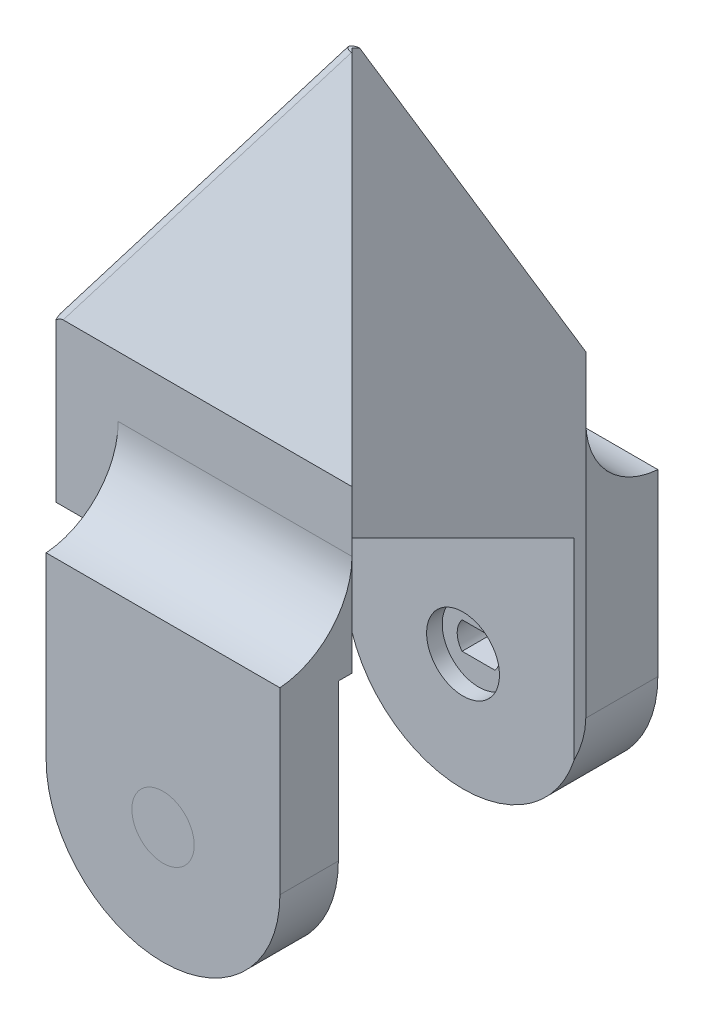
ISO-10303-21;
HEADER;
FILE_DESCRIPTION(('STEP AP214'),'2;1');
FILE_NAME('part.step','',(''),(''),'','','');
FILE_SCHEMA(('AUTOMOTIVE_DESIGN { 1 0 10303 214 1 1 1 1 }'));
ENDSEC;
DATA;
#1=APPLICATION_CONTEXT('core data for automotive mechanical design processes');
#2=APPLICATION_PROTOCOL_DEFINITION('international standard','automotive_design',2000,#1);
#3=PRODUCT_CONTEXT('',#1,'mechanical');
#4=PRODUCT('Part','Part','',(#3));
#5=PRODUCT_RELATED_PRODUCT_CATEGORY('part','',(#4));
#6=PRODUCT_DEFINITION_FORMATION('','',#4);
#7=PRODUCT_DEFINITION_CONTEXT('part definition',#1,'design');
#8=PRODUCT_DEFINITION('design','',#6,#7);
#9=PRODUCT_DEFINITION_SHAPE('','',#8);
#10=(LENGTH_UNIT() NAMED_UNIT(*) SI_UNIT(.MILLI.,.METRE.));
#11=(NAMED_UNIT(*) PLANE_ANGLE_UNIT() SI_UNIT($,.RADIAN.));
#12=(NAMED_UNIT(*) SI_UNIT($,.STERADIAN.) SOLID_ANGLE_UNIT());
#13=UNCERTAINTY_MEASURE_WITH_UNIT(LENGTH_MEASURE(1.E-05),#10,'distance_accuracy_value','');
#14=(GEOMETRIC_REPRESENTATION_CONTEXT(3) GLOBAL_UNCERTAINTY_ASSIGNED_CONTEXT((#13)) GLOBAL_UNIT_ASSIGNED_CONTEXT((#10,
#11,#12)) REPRESENTATION_CONTEXT('',''));
#15=CARTESIAN_POINT('',(0.,0.,0.));
#16=DIRECTION('',(0.,0.,1.));
#17=DIRECTION('',(1.,0.,0.));
#18=AXIS2_PLACEMENT_3D('',#15,#16,#17);
#19=CARTESIAN_POINT('',(1.4137996329211E-13,-20.0001000000003,-1.61370849898476));
#20=DIRECTION('',(0.,0.,1.));
#21=DIRECTION('',(1.,0.,0.));
#22=AXIS2_PLACEMENT_3D('',#19,#20,#21);
#23=CYLINDRICAL_SURFACE('',#22,4.);
#24=CARTESIAN_POINT('',(1.4137996329211E-13,-20.0001000000003,16.2));
#25=DIRECTION('',(0.,0.,1.));
#26=DIRECTION('',(1.,0.,0.));
#27=AXIS2_PLACEMENT_3D('',#24,#25,#26);
#28=CIRCLE('',#27,4.);
#29=CARTESIAN_POINT('',(4.00000000000014,-20.0001000000003,16.2));
#30=VERTEX_POINT('',#29);
#31=EDGE_CURVE('E12',#30,#30,#28,.F.);
#32=ORIENTED_EDGE('',*,*,#31,.F.);
#33=EDGE_LOOP('',(#32));
#34=FACE_BOUND('',#33,.T.);
#35=CARTESIAN_POINT('',(1.4137996329211E-13,-20.0001000000003,30.2));
#36=DIRECTION('',(0.,0.,1.));
#37=DIRECTION('',(1.,0.,0.));
#38=AXIS2_PLACEMENT_3D('',#35,#36,#37);
#39=CIRCLE('',#38,4.);
#40=CARTESIAN_POINT('',(4.00000000000014,-20.0001000000003,30.2));
#41=VERTEX_POINT('',#40);
#42=EDGE_CURVE('E58',#41,#41,#39,.T.);
#43=ORIENTED_EDGE('',*,*,#42,.F.);
#44=EDGE_LOOP('',(#43));
#45=FACE_BOUND('',#44,.T.);
#46=ADVANCED_FACE('F52',(#34,#45),#23,.T.);
#47=CARTESIAN_POINT('',(1.4137996329211E-13,-20.0001000000003,30.2));
#48=DIRECTION('',(0.,0.,1.));
#49=DIRECTION('',(1.,0.,0.));
#50=AXIS2_PLACEMENT_3D('',#47,#48,#49);
#51=PLANE('',#50);
#52=ORIENTED_EDGE('',*,*,#42,.T.);
#53=EDGE_LOOP('',(#52));
#54=FACE_BOUND('',#53,.T.);
#55=ADVANCED_FACE('F64',(#54),#51,.T.);
#56=CARTESIAN_POINT('',(23.0000000000001,-35.0001000000003,16.2));
#57=DIRECTION('',(0.,0.,1.));
#58=DIRECTION('',(1.,0.,0.));
#59=AXIS2_PLACEMENT_3D('',#56,#57,#58);
#60=PLANE('',#59);
#61=ORIENTED_EDGE('',*,*,#31,.T.);
#62=EDGE_LOOP('',(#61));
#63=FACE_BOUND('',#62,.T.);
#64=ADVANCED_FACE('F71',(#63),#60,.F.);
#65=CLOSED_SHELL('',(#46,#55,#64));
#66=MANIFOLD_SOLID_BREP('B2',#65);
#67=CARTESIAN_POINT('',(15.0000000000001,-0.000100000000315126,-18.3));
#68=DIRECTION('',(1.,0.,0.));
#69=DIRECTION('',(0.,1.,0.));
#70=AXIS2_PLACEMENT_3D('',#67,#68,#69);
#71=PLANE('',#70);
#72=DIRECTION('',(0.,1.,0.));
#73=VECTOR('',#72,1.);
#74=CARTESIAN_POINT('',(15.0000000000001,-35.0001000000003,20.95));
#75=LINE('',#74,#73);
#76=CARTESIAN_POINT('',(15.0000000000001,-9.99999997530754E-05,20.95));
#77=VERTEX_POINT('',#76);
#78=CARTESIAN_POINT('',(15.0000000000001,12.9717353375892,20.95));
#79=VERTEX_POINT('',#78);
#80=EDGE_CURVE('E285',#77,#79,#75,.T.);
#81=ORIENTED_EDGE('',*,*,#80,.T.);
#82=CARTESIAN_POINT('',(15.0000000000001,12.9717353375892,30.95));
#83=DIRECTION('',(1.,0.,0.));
#84=DIRECTION('',(0.,1.,0.));
#85=AXIS2_PLACEMENT_3D('',#82,#83,#84);
#86=CIRCLE('',#85,10.);
#87=CARTESIAN_POINT('',(15.0000000000001,2.99989999999968,30.2));
#88=VERTEX_POINT('',#87);
#89=EDGE_CURVE('E364',#79,#88,#86,.F.);
#90=ORIENTED_EDGE('',*,*,#89,.T.);
#91=DIRECTION('',(0.,1.,0.));
#92=VECTOR('',#91,1.);
#93=CARTESIAN_POINT('',(15.0000000000001,-0.000100000000315126,30.2));
#94=LINE('',#93,#92);
#95=CARTESIAN_POINT('',(15.0000000000001,-20.0001000000003,30.2));
#96=VERTEX_POINT('',#95);
#97=EDGE_CURVE('E344',#96,#88,#94,.T.);
#98=ORIENTED_EDGE('',*,*,#97,.F.);
#99=DIRECTION('',(0.,0.,1.));
#100=VECTOR('',#99,1.);
#101=CARTESIAN_POINT('',(15.0000000000001,-20.0001000000003,-18.3));
#102=LINE('',#101,#100);
#103=CARTESIAN_POINT('',(15.0000000000001,-20.0001000000003,22.7));
#104=VERTEX_POINT('',#103);
#105=EDGE_CURVE('E348',#104,#96,#102,.T.);
#106=ORIENTED_EDGE('',*,*,#105,.F.);
#107=DIRECTION('',(0.,-1.,0.));
#108=VECTOR('',#107,1.);
#109=CARTESIAN_POINT('',(15.0000000000001,-0.000100000000315126,22.7));
#110=LINE('',#109,#108);
#111=CARTESIAN_POINT('',(15.0000000000001,-9.99999997488304E-05,22.7));
#112=VERTEX_POINT('',#111);
#113=EDGE_CURVE('E336',#112,#104,#110,.T.);
#114=ORIENTED_EDGE('',*,*,#113,.F.);
#115=DIRECTION('',(0.,0.,-1.));
#116=VECTOR('',#115,1.);
#117=CARTESIAN_POINT('',(15.0000000000001,-0.000100000000323799,60.3496268633627));
#118=LINE('',#117,#116);
#119=EDGE_CURVE('E323',#112,#77,#118,.T.);
#120=ORIENTED_EDGE('',*,*,#119,.T.);
#121=EDGE_LOOP('',(#81,#90,#98,#106,#114,#120));
#122=FACE_BOUND('',#121,.T.);
#123=ADVANCED_FACE('F94',(#122),#71,.T.);
#124=CARTESIAN_POINT('',(-14.9999999999999,-0.000100000000323799,60.3496268633627));
#125=DIRECTION('',(0.,1.,0.));
#126=DIRECTION('',(0.,0.,1.));
#127=AXIS2_PLACEMENT_3D('',#124,#125,#126);
#128=PLANE('',#127);
#129=DIRECTION('',(-0.707106781186551,0.,0.707106781186544));
#130=VECTOR('',#129,1.);
#131=CARTESIAN_POINT('',(-34.6998134316813,-0.000100000000323799,40.649813431681));
#132=LINE('',#131,#130);
#133=CARTESIAN_POINT('',(14.2500000000001,-9.99999997530754E-05,-8.3));
#134=VERTEX_POINT('',#133);
#135=CARTESIAN_POINT('',(0.,-0.000100000000322065,5.95));
#136=VERTEX_POINT('',#135);
#137=EDGE_CURVE('E273',#134,#136,#132,.T.);
#138=ORIENTED_EDGE('',*,*,#137,.T.);
#139=DIRECTION('',(0.707106781186551,0.,0.707106781186544));
#140=VECTOR('',#139,1.);
#141=CARTESIAN_POINT('',(19.6998134316813,-0.000100000000323799,25.6498134316811));
#142=LINE('',#141,#140);
#143=EDGE_CURVE('E498',#136,#77,#142,.T.);
#144=ORIENTED_EDGE('',*,*,#143,.T.);
#145=ORIENTED_EDGE('',*,*,#119,.F.);
#146=DIRECTION('',(-1.,0.,0.));
#147=VECTOR('',#146,1.);
#148=CARTESIAN_POINT('',(23.0000000000001,-9.99999997370343E-05,22.7));
#149=LINE('',#148,#147);
#150=CARTESIAN_POINT('',(-14.9999999999999,-0.000100000000323799,22.7));
#151=VERTEX_POINT('',#150);
#152=EDGE_CURVE('E333',#112,#151,#149,.T.);
#153=ORIENTED_EDGE('',*,*,#152,.T.);
#154=DIRECTION('',(0.,0.,-1.));
#155=VECTOR('',#154,1.);
#156=CARTESIAN_POINT('',(-14.9999999999999,-0.000100000000323799,60.3496268633627));
#157=LINE('',#156,#155);
#158=CARTESIAN_POINT('',(-14.9999999999999,-9.99999997923149E-05,20.95));
#159=VERTEX_POINT('',#158);
#160=EDGE_CURVE('E318',#151,#159,#157,.T.);
#161=ORIENTED_EDGE('',*,*,#160,.T.);
#162=DIRECTION('',(-1.,0.,0.));
#163=VECTOR('',#162,1.);
#164=CARTESIAN_POINT('',(-23.,-9.99999996815495E-05,20.95));
#165=LINE('',#164,#163);
#166=CARTESIAN_POINT('',(-23.,-9.99999996815495E-05,20.95));
#167=VERTEX_POINT('',#166);
#168=EDGE_CURVE('E460',#159,#167,#165,.T.);
#169=ORIENTED_EDGE('',*,*,#168,.T.);
#170=DIRECTION('',(0.,0.,-1.));
#171=VECTOR('',#170,1.);
#172=CARTESIAN_POINT('',(-23.,-9.99999996815495E-05,-9.05));
#173=LINE('',#172,#171);
#174=CARTESIAN_POINT('',(-23.,-9.99999996815495E-05,-9.05));
#175=VERTEX_POINT('',#174);
#176=EDGE_CURVE('E303',#167,#175,#173,.T.);
#177=ORIENTED_EDGE('',*,*,#176,.T.);
#178=DIRECTION('',(1.,0.,0.));
#179=VECTOR('',#178,1.);
#180=CARTESIAN_POINT('',(-23.,-9.99999996815495E-05,-9.05));
#181=LINE('',#180,#179);
#182=CARTESIAN_POINT('',(-14.9999999999999,-9.99999997923149E-05,-9.05));
#183=VERTEX_POINT('',#182);
#184=EDGE_CURVE('E471',#175,#183,#181,.T.);
#185=ORIENTED_EDGE('',*,*,#184,.T.);
#186=DIRECTION('',(0.,0.,1.));
#187=VECTOR('',#186,1.);
#188=CARTESIAN_POINT('',(-14.9999999999999,-0.000100000000323799,-18.3));
#189=LINE('',#188,#187);
#190=CARTESIAN_POINT('',(-14.9999999999999,-9.99999997968623E-05,-8.3));
#191=VERTEX_POINT('',#190);
#192=EDGE_CURVE('E299',#183,#191,#189,.T.);
#193=ORIENTED_EDGE('',*,*,#192,.T.);
#194=DIRECTION('',(-1.,0.,0.));
#195=VECTOR('',#194,1.);
#196=CARTESIAN_POINT('',(23.0000000000001,-9.99999997408307E-05,-8.3));
#197=LINE('',#196,#195);
#198=EDGE_CURVE('E291',#134,#191,#197,.T.);
#199=ORIENTED_EDGE('',*,*,#198,.F.);
#200=EDGE_LOOP('',(#138,#144,#145,#153,#161,#169,#177,#185,#193,#199));
#201=FACE_BOUND('',#200,.T.);
#202=ADVANCED_FACE('F505',(#201),#128,.F.);
#203=CARTESIAN_POINT('',(1.41431665121928E-13,-20.0001000000003,30.2));
#204=DIRECTION('',(0.,0.,1.));
#205=DIRECTION('',(1.,0.,0.));
#206=AXIS2_PLACEMENT_3D('',#203,#204,#205);
#207=PLANE('',#206);
#208=CARTESIAN_POINT('',(1.41431665121928E-13,-20.0001000000003,30.2));
#209=DIRECTION('',(0.,0.,1.));
#210=DIRECTION('',(1.,0.,0.));
#211=AXIS2_PLACEMENT_3D('',#208,#209,#210);
#212=CIRCLE('',#211,4.);
#213=CARTESIAN_POINT('',(4.00000000000014,-20.0001000000003,30.2));
#214=VERTEX_POINT('',#213);
#215=EDGE_CURVE('E322',#214,#214,#212,.T.);
#216=ORIENTED_EDGE('',*,*,#215,.F.);
#217=EDGE_LOOP('',(#216));
#218=FACE_BOUND('',#217,.T.);
#219=DIRECTION('',(0.,-1.,0.));
#220=VECTOR('',#219,1.);
#221=CARTESIAN_POINT('',(-14.9999999999999,-0.000100000000323799,30.2));
#222=LINE('',#221,#220);
#223=CARTESIAN_POINT('',(-14.9999999999999,2.99989999999968,30.2));
#224=VERTEX_POINT('',#223);
#225=CARTESIAN_POINT('',(-14.9999999999999,-20.0001000000003,30.2));
#226=VERTEX_POINT('',#225);
#227=EDGE_CURVE('E338',#224,#226,#222,.T.);
#228=ORIENTED_EDGE('',*,*,#227,.T.);
#229=CARTESIAN_POINT('',(1.41431665121928E-13,-20.0001000000003,30.2));
#230=DIRECTION('',(0.,0.,1.));
#231=DIRECTION('',(1.,0.,0.));
#232=AXIS2_PLACEMENT_3D('',#229,#230,#231);
#233=CIRCLE('',#232,15.);
#234=EDGE_CURVE('E341',#226,#96,#233,.T.);
#235=ORIENTED_EDGE('',*,*,#234,.T.);
#236=ORIENTED_EDGE('',*,*,#97,.T.);
#237=DIRECTION('',(-1.,0.,0.));
#238=VECTOR('',#237,1.);
#239=CARTESIAN_POINT('',(-14.9999999999999,2.99989999999968,30.2));
#240=LINE('',#239,#238);
#241=EDGE_CURVE('E319',#88,#224,#240,.T.);
#242=ORIENTED_EDGE('',*,*,#241,.T.);
#243=EDGE_LOOP('',(#228,#235,#236,#242));
#244=FACE_BOUND('',#243,.T.);
#245=ADVANCED_FACE('F549',(#218,#244),#207,.T.);
#246=CARTESIAN_POINT('',(1.41431665121928E-13,-20.0001000000003,-18.3));
#247=DIRECTION('',(0.,0.,1.));
#248=DIRECTION('',(1.,0.,0.));
#249=AXIS2_PLACEMENT_3D('',#246,#247,#248);
#250=CYLINDRICAL_SURFACE('',#249,15.);
#251=DIRECTION('',(0.,0.,1.));
#252=VECTOR('',#251,1.);
#253=CARTESIAN_POINT('',(-14.9999999999999,-20.0001000000003,-18.3));
#254=LINE('',#253,#252);
#255=CARTESIAN_POINT('',(-14.9999999999998,-20.0001000000003,22.7));
#256=VERTEX_POINT('',#255);
#257=EDGE_CURVE('E347',#256,#226,#254,.T.);
#258=ORIENTED_EDGE('',*,*,#257,.F.);
#259=CARTESIAN_POINT('',(1.41431665121928E-13,-20.0001000000003,22.7));
#260=DIRECTION('',(0.,0.,1.));
#261=DIRECTION('',(1.,0.,0.));
#262=AXIS2_PLACEMENT_3D('',#259,#260,#261);
#263=CIRCLE('',#262,15.);
#264=EDGE_CURVE('E350',#104,#256,#263,.F.);
#265=ORIENTED_EDGE('',*,*,#264,.F.);
#266=ORIENTED_EDGE('',*,*,#105,.T.);
#267=ORIENTED_EDGE('',*,*,#234,.F.);
#268=EDGE_LOOP('',(#258,#265,#266,#267));
#269=FACE_BOUND('',#268,.T.);
#270=ADVANCED_FACE('F554',(#269),#250,.T.);
#271=DIRECTION('',(0.,1.,0.));
#272=VECTOR('',#271,1.);
#273=CARTESIAN_POINT('',(15.0000000000001,-35.0001000000003,-9.05));
#274=LINE('',#273,#272);
#275=CARTESIAN_POINT('',(15.0000000000001,-20.0001000000003,-9.05));
#276=VERTEX_POINT('',#275);
#277=CARTESIAN_POINT('',(15.0000000000001,12.9717353375892,-9.05));
#278=VERTEX_POINT('',#277);
#279=EDGE_CURVE('E265',#276,#278,#274,.T.);
#280=ORIENTED_EDGE('',*,*,#279,.F.);
#281=DIRECTION('',(0.,0.,1.));
#282=VECTOR('',#281,1.);
#283=CARTESIAN_POINT('',(15.0000000000001,-20.0001000000003,-18.3));
#284=LINE('',#283,#282);
#285=CARTESIAN_POINT('',(15.0000000000001,-20.0001000000003,-18.3));
#286=VERTEX_POINT('',#285);
#287=EDGE_CURVE('E280',#286,#276,#284,.T.);
#288=ORIENTED_EDGE('',*,*,#287,.F.);
#289=DIRECTION('',(0.,-1.,0.));
#290=VECTOR('',#289,1.);
#291=CARTESIAN_POINT('',(15.0000000000001,-0.000100000000323799,-18.3));
#292=LINE('',#291,#290);
#293=CARTESIAN_POINT('',(15.0000000000001,2.99989999999968,-18.3));
#294=VERTEX_POINT('',#293);
#295=EDGE_CURVE('E311',#294,#286,#292,.T.);
#296=ORIENTED_EDGE('',*,*,#295,.F.);
#297=CARTESIAN_POINT('',(15.0000000000001,12.9717353375892,-19.05));
#298=DIRECTION('',(1.,0.,0.));
#299=DIRECTION('',(0.,1.,0.));
#300=AXIS2_PLACEMENT_3D('',#297,#298,#299);
#301=CIRCLE('',#300,10.);
#302=EDGE_CURVE('E283',#294,#278,#301,.F.);
#303=ORIENTED_EDGE('',*,*,#302,.T.);
#304=EDGE_LOOP('',(#280,#288,#296,#303));
#305=FACE_BOUND('',#304,.T.);
#306=ADVANCED_FACE('F278',(#305),#71,.T.);
#307=CARTESIAN_POINT('',(-14.9999999999999,-0.000100000000323799,-18.3));
#308=DIRECTION('',(-1.,0.,0.));
#309=DIRECTION('',(0.,-1.,0.));
#310=AXIS2_PLACEMENT_3D('',#307,#308,#309);
#311=PLANE('',#310);
#312=DIRECTION('',(0.,1.,0.));
#313=VECTOR('',#312,1.);
#314=CARTESIAN_POINT('',(-14.9999999999999,-0.000100000000323799,20.95));
#315=LINE('',#314,#313);
#316=CARTESIAN_POINT('',(-14.9999999999999,12.9717353375892,20.95));
#317=VERTEX_POINT('',#316);
#318=EDGE_CURVE('E309',#159,#317,#315,.T.);
#319=ORIENTED_EDGE('',*,*,#318,.F.);
#320=ORIENTED_EDGE('',*,*,#160,.F.);
#321=DIRECTION('',(0.,1.,0.));
#322=VECTOR('',#321,1.);
#323=CARTESIAN_POINT('',(-14.9999999999998,-35.0001000000003,22.7));
#324=LINE('',#323,#322);
#325=EDGE_CURVE('E331',#256,#151,#324,.T.);
#326=ORIENTED_EDGE('',*,*,#325,.F.);
#327=ORIENTED_EDGE('',*,*,#257,.T.);
#328=ORIENTED_EDGE('',*,*,#227,.F.);
#329=CARTESIAN_POINT('',(-14.9999999999999,12.9717353375892,30.95));
#330=DIRECTION('',(-1.,0.,0.));
#331=DIRECTION('',(0.,-1.,0.));
#332=AXIS2_PLACEMENT_3D('',#329,#330,#331);
#333=CIRCLE('',#332,10.);
#334=EDGE_CURVE('E361',#224,#317,#333,.F.);
#335=ORIENTED_EDGE('',*,*,#334,.T.);
#336=EDGE_LOOP('',(#319,#320,#326,#327,#328,#335));
#337=FACE_BOUND('',#336,.T.);
#338=ADVANCED_FACE('F526',(#337),#311,.T.);
#339=CARTESIAN_POINT('',(23.0000000000001,-35.0001000000003,22.7));
#340=DIRECTION('',(0.,0.,1.));
#341=DIRECTION('',(1.,0.,0.));
#342=AXIS2_PLACEMENT_3D('',#339,#340,#341);
#343=PLANE('',#342);
#344=CARTESIAN_POINT('',(1.41431665121928E-13,-20.0001000000003,22.7));
#345=DIRECTION('',(0.,0.,1.));
#346=DIRECTION('',(1.,0.,0.));
#347=AXIS2_PLACEMENT_3D('',#344,#345,#346);
#348=CIRCLE('',#347,4.);
#349=CARTESIAN_POINT('',(4.00000000000014,-20.0001000000003,22.7));
#350=VERTEX_POINT('',#349);
#351=EDGE_CURVE('E330',#350,#350,#348,.T.);
#352=ORIENTED_EDGE('',*,*,#351,.T.);
#353=EDGE_LOOP('',(#352));
#354=FACE_BOUND('',#353,.T.);
#355=ORIENTED_EDGE('',*,*,#113,.T.);
#356=ORIENTED_EDGE('',*,*,#264,.T.);
#357=ORIENTED_EDGE('',*,*,#325,.T.);
#358=ORIENTED_EDGE('',*,*,#152,.F.);
#359=EDGE_LOOP('',(#355,#356,#357,#358));
#360=FACE_BOUND('',#359,.T.);
#361=ADVANCED_FACE('F559',(#354,#360),#343,.F.);
#362=CARTESIAN_POINT('',(1.41431665121928E-13,-20.0001000000003,-18.3));
#363=DIRECTION('',(0.,0.,1.));
#364=DIRECTION('',(1.,0.,0.));
#365=AXIS2_PLACEMENT_3D('',#362,#363,#364);
#366=CYLINDRICAL_SURFACE('',#365,4.);
#367=CARTESIAN_POINT('',(4.00000000000014,-20.0001000000003,30.2));
#368=CARTESIAN_POINT('',(4.00000000000014,-20.0001000000003,30.121875));
#369=CARTESIAN_POINT('',(4.00000000000014,-20.0001000000003,30.04375));
#370=CARTESIAN_POINT('',(4.00000000000014,-20.0001000000003,29.8875));
#371=CARTESIAN_POINT('',(4.00000000000014,-20.0001000000003,29.809375));
#372=CARTESIAN_POINT('',(4.00000000000014,-20.0001000000003,29.653125));
#373=CARTESIAN_POINT('',(4.00000000000014,-20.0001000000003,29.575));
#374=CARTESIAN_POINT('',(4.00000000000014,-20.0001000000003,29.41875));
#375=CARTESIAN_POINT('',(4.00000000000014,-20.0001000000003,29.340625));
#376=CARTESIAN_POINT('',(4.00000000000014,-20.0001000000003,29.184375));
#377=CARTESIAN_POINT('',(4.00000000000014,-20.0001000000003,29.10625));
#378=CARTESIAN_POINT('',(4.00000000000014,-20.0001000000003,28.95));
#379=CARTESIAN_POINT('',(4.00000000000014,-20.0001000000003,28.871875));
#380=CARTESIAN_POINT('',(4.00000000000014,-20.0001000000003,28.715625));
#381=CARTESIAN_POINT('',(4.00000000000014,-20.0001000000003,28.6375));
#382=CARTESIAN_POINT('',(4.00000000000014,-20.0001000000003,28.48125));
#383=CARTESIAN_POINT('',(4.00000000000014,-20.0001000000003,28.403125));
#384=CARTESIAN_POINT('',(4.00000000000014,-20.0001000000003,28.246875));
#385=CARTESIAN_POINT('',(4.00000000000014,-20.0001000000003,28.16875));
#386=CARTESIAN_POINT('',(4.00000000000014,-20.0001000000003,28.0125));
#387=CARTESIAN_POINT('',(4.00000000000014,-20.0001000000003,27.934375));
#388=CARTESIAN_POINT('',(4.00000000000014,-20.0001000000003,27.778125));
#389=CARTESIAN_POINT('',(4.00000000000014,-20.0001000000003,27.7));
#390=CARTESIAN_POINT('',(4.00000000000014,-20.0001000000003,27.54375));
#391=CARTESIAN_POINT('',(4.00000000000014,-20.0001000000003,27.465625));
#392=CARTESIAN_POINT('',(4.00000000000014,-20.0001000000003,27.309375));
#393=CARTESIAN_POINT('',(4.00000000000014,-20.0001000000003,27.23125));
#394=CARTESIAN_POINT('',(4.00000000000014,-20.0001000000003,27.075));
#395=CARTESIAN_POINT('',(4.00000000000014,-20.0001000000003,26.996875));
#396=CARTESIAN_POINT('',(4.00000000000014,-20.0001000000003,26.840625));
#397=CARTESIAN_POINT('',(4.00000000000014,-20.0001000000003,26.7625));
#398=CARTESIAN_POINT('',(4.00000000000014,-20.0001000000003,26.60625));
#399=CARTESIAN_POINT('',(4.00000000000014,-20.0001000000003,26.528125));
#400=CARTESIAN_POINT('',(4.00000000000014,-20.0001000000003,26.371875));
#401=CARTESIAN_POINT('',(4.00000000000014,-20.0001000000003,26.29375));
#402=CARTESIAN_POINT('',(4.00000000000014,-20.0001000000003,26.1375));
#403=CARTESIAN_POINT('',(4.00000000000014,-20.0001000000003,26.059375));
#404=CARTESIAN_POINT('',(4.00000000000014,-20.0001000000003,25.903125));
#405=CARTESIAN_POINT('',(4.00000000000014,-20.0001000000003,25.825));
#406=CARTESIAN_POINT('',(4.00000000000014,-20.0001000000003,25.66875));
#407=CARTESIAN_POINT('',(4.00000000000014,-20.0001000000003,25.590625));
#408=CARTESIAN_POINT('',(4.00000000000014,-20.0001000000003,25.434375));
#409=CARTESIAN_POINT('',(4.00000000000014,-20.0001000000003,25.35625));
#410=CARTESIAN_POINT('',(4.00000000000014,-20.0001000000003,25.2));
#411=CARTESIAN_POINT('',(4.00000000000014,-20.0001000000003,25.121875));
#412=CARTESIAN_POINT('',(4.00000000000014,-20.0001000000003,24.965625));
#413=CARTESIAN_POINT('',(4.00000000000014,-20.0001000000003,24.8875));
#414=CARTESIAN_POINT('',(4.00000000000014,-20.0001000000003,24.73125));
#415=CARTESIAN_POINT('',(4.00000000000014,-20.0001000000003,24.653125));
#416=CARTESIAN_POINT('',(4.00000000000014,-20.0001000000003,24.496875));
#417=CARTESIAN_POINT('',(4.00000000000014,-20.0001000000003,24.41875));
#418=CARTESIAN_POINT('',(4.00000000000014,-20.0001000000003,24.2625));
#419=CARTESIAN_POINT('',(4.00000000000014,-20.0001000000003,24.184375));
#420=CARTESIAN_POINT('',(4.00000000000014,-20.0001000000003,24.028125));
#421=CARTESIAN_POINT('',(4.00000000000014,-20.0001000000003,23.95));
#422=CARTESIAN_POINT('',(4.00000000000014,-20.0001000000003,23.79375));
#423=CARTESIAN_POINT('',(4.00000000000014,-20.0001000000003,23.715625));
#424=CARTESIAN_POINT('',(4.00000000000014,-20.0001000000003,23.559375));
#425=CARTESIAN_POINT('',(4.00000000000014,-20.0001000000003,23.48125));
#426=CARTESIAN_POINT('',(4.00000000000014,-20.0001000000003,23.325));
#427=CARTESIAN_POINT('',(4.00000000000014,-20.0001000000003,23.246875));
#428=CARTESIAN_POINT('',(4.00000000000014,-20.0001000000003,23.090625));
#429=CARTESIAN_POINT('',(4.00000000000014,-20.0001000000003,23.0125));
#430=CARTESIAN_POINT('',(4.00000000000014,-20.0001000000003,22.85625));
#431=CARTESIAN_POINT('',(4.00000000000014,-20.0001000000003,22.778125));
#432=CARTESIAN_POINT('',(4.00000000000014,-20.0001000000003,22.7));
#433=B_SPLINE_CURVE_WITH_KNOTS('',3,(#367,#368,#369,#370,#371,#372,#373,#374,#375,#376,#377,
#378,#379,#380,#381,#382,#383,#384,#385,#386,#387,#388,#389,#390,#391,#392,#393,#394,#395,#396,
#397,#398,#399,#400,#401,#402,#403,#404,#405,#406,#407,#408,#409,#410,#411,#412,#413,#414,#415,
#416,#417,#418,#419,#420,#421,#422,#423,#424,#425,#426,#427,#428,#429,#430,#431,#432),
.UNSPECIFIED.,.F.,.F.,(4,2,2,2,2,2,2,2,2,2,2,2,2,2,2,2,2,2,2,2,2,2,2,2,2,2,2,2,2,2,2,2,4),(0.,
0.234375000000002,0.468750000000004,0.703124999999999,0.937500000000001,1.171875,1.40625,
1.640625,1.875,2.109375,2.34375000000001,2.578125,2.8125,3.046875,3.28125,3.515625,3.75,
3.98437500000001,4.21875000000001,4.453125,4.6875,4.92187500000001,5.15625,5.390625,
5.62500000000001,5.85937500000001,6.09375000000001,6.328125,6.56250000000001,6.79687500000001,
7.03125,7.265625,7.50000000000001),.UNSPECIFIED.);
#434=EDGE_CURVE('BSEAM768',#214,#350,#433,.T.);
#435=ORIENTED_EDGE('',*,*,#215,.T.);
#436=ORIENTED_EDGE('',*,*,#351,.F.);
#437=ORIENTED_EDGE('',*,*,#434,.T.);
#438=ORIENTED_EDGE('',*,*,#434,.F.);
#439=EDGE_LOOP('',(#435,#437,#436,#438));
#440=FACE_BOUND('',#439,.T.);
#441=ADVANCED_FACE('F768',(#440),#366,.F.);
#442=CARTESIAN_POINT('',(2.12132034355978,-21.7501000000003,9.15029810621144));
#443=DIRECTION('',(0.,-1.,0.));
#444=DIRECTION('',(0.,0.,-1.));
#445=AXIS2_PLACEMENT_3D('',#442,#443,#444);
#446=PLANE('',#445);
#447=DIRECTION('',(-1.,0.,0.));
#448=VECTOR('',#447,1.);
#449=CARTESIAN_POINT('',(2.12132034355978,-21.7501000000003,-10.3));
#450=LINE('',#449,#448);
#451=CARTESIAN_POINT('',(2.12132034355978,-21.7501000000003,-10.3));
#452=VERTEX_POINT('',#451);
#453=CARTESIAN_POINT('',(-2.1213203435595,-21.7501000000003,-10.3));
#454=VERTEX_POINT('',#453);
#455=EDGE_CURVE('E443',#452,#454,#450,.T.);
#456=ORIENTED_EDGE('',*,*,#455,.F.);
#457=DIRECTION('',(0.,0.,-1.));
#458=VECTOR('',#457,1.);
#459=CARTESIAN_POINT('',(2.12132034355978,-21.7501000000003,9.15029810621144));
#460=LINE('',#459,#458);
#461=CARTESIAN_POINT('',(2.12132034355978,-21.7501000000003,-18.3));
#462=VERTEX_POINT('',#461);
#463=EDGE_CURVE('E457',#452,#462,#460,.T.);
#464=ORIENTED_EDGE('',*,*,#463,.T.);
#465=DIRECTION('',(-1.,0.,0.));
#466=VECTOR('',#465,1.);
#467=CARTESIAN_POINT('',(2.12132034355978,-21.7501000000003,-18.3));
#468=LINE('',#467,#466);
#469=CARTESIAN_POINT('',(-2.1213203435595,-21.7501000000003,-18.3));
#470=VERTEX_POINT('',#469);
#471=EDGE_CURVE('E448',#462,#470,#468,.T.);
#472=ORIENTED_EDGE('',*,*,#471,.T.);
#473=DIRECTION('',(0.,0.,-1.));
#474=VECTOR('',#473,1.);
#475=CARTESIAN_POINT('',(-2.1213203435595,-21.7501000000003,9.15029810621144));
#476=LINE('',#475,#474);
#477=EDGE_CURVE('E463',#454,#470,#476,.T.);
#478=ORIENTED_EDGE('',*,*,#477,.F.);
#479=EDGE_LOOP('',(#456,#464,#472,#478));
#480=FACE_BOUND('',#479,.T.);
#481=ADVANCED_FACE('F759',(#480),#446,.F.);
#482=CARTESIAN_POINT('',(1.4137996329211E-13,-20.0001000000003,9.15029810621144));
#483=DIRECTION('',(0.,0.,-1.));
#484=DIRECTION('',(-1.,0.,0.));
#485=AXIS2_PLACEMENT_3D('',#482,#483,#484);
#486=CYLINDRICAL_SURFACE('',#485,2.75);
#487=CARTESIAN_POINT('',(1.4137996329211E-13,-20.0001000000003,-10.3));
#488=DIRECTION('',(0.,0.,1.));
#489=DIRECTION('',(1.,0.,0.));
#490=AXIS2_PLACEMENT_3D('',#487,#488,#489);
#491=CIRCLE('',#490,2.75);
#492=CARTESIAN_POINT('',(-2.1213203435595,-18.2501000000003,-10.3));
#493=VERTEX_POINT('',#492);
#494=EDGE_CURVE('E441',#454,#493,#491,.F.);
#495=ORIENTED_EDGE('',*,*,#494,.F.);
#496=ORIENTED_EDGE('',*,*,#477,.T.);
#497=CARTESIAN_POINT('',(1.4137996329211E-13,-20.0001000000003,-18.3));
#498=DIRECTION('',(0.,0.,-1.));
#499=DIRECTION('',(1.,0.,0.));
#500=AXIS2_PLACEMENT_3D('',#497,#498,#499);
#501=CIRCLE('',#500,2.75);
#502=CARTESIAN_POINT('',(-2.1213203435595,-18.2501000000003,-18.3));
#503=VERTEX_POINT('',#502);
#504=EDGE_CURVE('E451',#470,#503,#501,.T.);
#505=ORIENTED_EDGE('',*,*,#504,.T.);
#506=DIRECTION('',(0.,0.,-1.));
#507=VECTOR('',#506,1.);
#508=CARTESIAN_POINT('',(-2.1213203435595,-18.2501000000003,9.15029810621144));
#509=LINE('',#508,#507);
#510=EDGE_CURVE('E461',#493,#503,#509,.T.);
#511=ORIENTED_EDGE('',*,*,#510,.F.);
#512=EDGE_LOOP('',(#495,#496,#505,#511));
#513=FACE_BOUND('',#512,.T.);
#514=ADVANCED_FACE('F750',(#513),#486,.F.);
#515=CARTESIAN_POINT('',(2.12132034355978,-18.2501000000003,9.15029810621144));
#516=DIRECTION('',(0.,1.,0.));
#517=DIRECTION('',(0.,0.,1.));
#518=AXIS2_PLACEMENT_3D('',#515,#516,#517);
#519=PLANE('',#518);
#520=DIRECTION('',(1.,0.,0.));
#521=VECTOR('',#520,1.);
#522=CARTESIAN_POINT('',(2.12132034355978,-18.2501000000003,-10.3));
#523=LINE('',#522,#521);
#524=CARTESIAN_POINT('',(2.12132034355978,-18.2501000000003,-10.3));
#525=VERTEX_POINT('',#524);
#526=EDGE_CURVE('E437',#493,#525,#523,.T.);
#527=ORIENTED_EDGE('',*,*,#526,.F.);
#528=ORIENTED_EDGE('',*,*,#510,.T.);
#529=DIRECTION('',(1.,0.,0.));
#530=VECTOR('',#529,1.);
#531=CARTESIAN_POINT('',(2.12132034355978,-18.2501000000003,-18.3));
#532=LINE('',#531,#530);
#533=CARTESIAN_POINT('',(2.12132034355978,-18.2501000000003,-18.3));
#534=VERTEX_POINT('',#533);
#535=EDGE_CURVE('E454',#503,#534,#532,.T.);
#536=ORIENTED_EDGE('',*,*,#535,.T.);
#537=DIRECTION('',(0.,0.,-1.));
#538=VECTOR('',#537,1.);
#539=CARTESIAN_POINT('',(2.12132034355978,-18.2501000000003,9.15029810621144));
#540=LINE('',#539,#538);
#541=EDGE_CURVE('E458',#525,#534,#540,.T.);
#542=ORIENTED_EDGE('',*,*,#541,.F.);
#543=EDGE_LOOP('',(#527,#528,#536,#542));
#544=FACE_BOUND('',#543,.T.);
#545=ADVANCED_FACE('F741',(#544),#519,.F.);
#546=CARTESIAN_POINT('',(1.4137996329211E-13,-20.0001000000003,9.15029810621144));
#547=DIRECTION('',(0.,0.,-1.));
#548=DIRECTION('',(-1.,0.,0.));
#549=AXIS2_PLACEMENT_3D('',#546,#547,#548);
#550=CYLINDRICAL_SURFACE('',#549,2.75);
#551=CARTESIAN_POINT('',(1.4137996329211E-13,-20.0001000000003,-10.3));
#552=DIRECTION('',(0.,0.,1.));
#553=DIRECTION('',(1.,0.,0.));
#554=AXIS2_PLACEMENT_3D('',#551,#552,#553);
#555=CIRCLE('',#554,2.75);
#556=EDGE_CURVE('E304',#525,#452,#555,.F.);
#557=ORIENTED_EDGE('',*,*,#556,.F.);
#558=ORIENTED_EDGE('',*,*,#541,.T.);
#559=CARTESIAN_POINT('',(1.4137996329211E-13,-20.0001000000003,-18.3));
#560=DIRECTION('',(0.,0.,-1.));
#561=DIRECTION('',(-1.,0.,0.));
#562=AXIS2_PLACEMENT_3D('',#559,#560,#561);
#563=CIRCLE('',#562,2.75);
#564=EDGE_CURVE('E445',#534,#462,#563,.T.);
#565=ORIENTED_EDGE('',*,*,#564,.T.);
#566=ORIENTED_EDGE('',*,*,#463,.F.);
#567=EDGE_LOOP('',(#557,#558,#565,#566));
#568=FACE_BOUND('',#567,.T.);
#569=ADVANCED_FACE('F732',(#568),#550,.F.);
#570=CARTESIAN_POINT('',(0.,40.,20.95));
#571=DIRECTION('',(0.,0.,1.));
#572=DIRECTION('',(1.,0.,0.));
#573=AXIS2_PLACEMENT_3D('',#570,#571,#572);
#574=PLANE('',#573);
#575=DIRECTION('',(-1.,0.,0.));
#576=VECTOR('',#575,1.);
#577=CARTESIAN_POINT('',(15.0000000000001,20.7288672611368,20.95));
#578=LINE('',#577,#576);
#579=CARTESIAN_POINT('',(15.0000000000001,20.7288672611368,20.95));
#580=VERTEX_POINT('',#579);
#581=CARTESIAN_POINT('',(-22.0614005388049,20.7288672611368,20.95));
#582=VERTEX_POINT('',#581);
#583=EDGE_CURVE('E417',#580,#582,#578,.T.);
#584=ORIENTED_EDGE('',*,*,#583,.T.);
#585=CARTESIAN_POINT('',(-23.4869390148187,18.197233149377,20.95));
#586=DIRECTION('',(0.,0.,1.));
#587=DIRECTION('',(-0.555001210032669,-0.831849539798078,0.));
#588=AXIS2_PLACEMENT_3D('',#585,#586,#587);
#589=ELLIPSE('',#588,2.96934657392227,1.);
#590=CARTESIAN_POINT('',(-23.,20.2644385507593,20.95));
#591=VERTEX_POINT('',#590);
#592=EDGE_CURVE('E377',#582,#591,#589,.T.);
#593=ORIENTED_EDGE('',*,*,#592,.T.);
#594=DIRECTION('',(0.,-1.,0.));
#595=VECTOR('',#594,1.);
#596=CARTESIAN_POINT('',(-23.,40.,20.95));
#597=LINE('',#596,#595);
#598=EDGE_CURVE('E467',#591,#167,#597,.T.);
#599=ORIENTED_EDGE('',*,*,#598,.T.);
#600=ORIENTED_EDGE('',*,*,#168,.F.);
#601=ORIENTED_EDGE('',*,*,#318,.T.);
#602=DIRECTION('',(1.,0.,0.));
#603=VECTOR('',#602,1.);
#604=CARTESIAN_POINT('',(15.0000000000001,12.9717353375892,20.95));
#605=LINE('',#604,#603);
#606=EDGE_CURVE('E353',#317,#79,#605,.T.);
#607=ORIENTED_EDGE('',*,*,#606,.T.);
#608=DIRECTION('',(0.,-1.,0.));
#609=VECTOR('',#608,1.);
#610=CARTESIAN_POINT('',(15.0000000000001,54.7095107671614,20.95));
#611=LINE('',#610,#609);
#612=EDGE_CURVE('E430',#580,#79,#611,.T.);
#613=ORIENTED_EDGE('',*,*,#612,.F.);
#614=EDGE_LOOP('',(#584,#593,#599,#600,#601,#607,#613));
#615=FACE_BOUND('',#614,.T.);
#616=ADVANCED_FACE('F512',(#615),#574,.T.);
#617=CARTESIAN_POINT('',(-23.,40.,20.95));
#618=DIRECTION('',(1.,0.,0.));
#619=DIRECTION('',(0.,1.,0.));
#620=AXIS2_PLACEMENT_3D('',#617,#618,#619);
#621=PLANE('',#620);
#622=ORIENTED_EDGE('',*,*,#598,.F.);
#623=CARTESIAN_POINT('',(-23.,18.9270693876851,20.6361948571168));
#624=DIRECTION('',(1.,0.,0.));
#625=DIRECTION('',(0.,-0.918680351208952,0.39500178772076));
#626=AXIS2_PLACEMENT_3D('',#623,#624,#625);
#627=ELLIPSE('',#626,1.91357890319435,1.);
#628=CARTESIAN_POINT('',(-23.,20.7288672611368,20.1001140425803));
#629=VERTEX_POINT('',#628);
#630=EDGE_CURVE('E381',#591,#629,#627,.F.);
#631=ORIENTED_EDGE('',*,*,#630,.T.);
#632=DIRECTION('',(0.,0.,1.));
#633=VECTOR('',#632,1.);
#634=CARTESIAN_POINT('',(-23.,20.7288672611368,-18.3));
#635=LINE('',#634,#633);
#636=CARTESIAN_POINT('',(-23.,20.7288672611368,-8.20011404258028));
#637=VERTEX_POINT('',#636);
#638=EDGE_CURVE('E503',#637,#629,#635,.T.);
#639=ORIENTED_EDGE('',*,*,#638,.F.);
#640=CARTESIAN_POINT('',(-23.,18.9270693876851,-8.73619485711681));
#641=DIRECTION('',(1.,0.,0.));
#642=DIRECTION('',(0.,0.918680351208952,0.39500178772076));
#643=AXIS2_PLACEMENT_3D('',#640,#641,#642);
#644=ELLIPSE('',#643,1.91357890319435,1.);
#645=CARTESIAN_POINT('',(-23.,20.2644385507593,-9.05));
#646=VERTEX_POINT('',#645);
#647=EDGE_CURVE('E379',#637,#646,#644,.F.);
#648=ORIENTED_EDGE('',*,*,#647,.T.);
#649=DIRECTION('',(0.,-1.,0.));
#650=VECTOR('',#649,1.);
#651=CARTESIAN_POINT('',(-23.,40.,-9.05));
#652=LINE('',#651,#650);
#653=EDGE_CURVE('E469',#646,#175,#652,.T.);
#654=ORIENTED_EDGE('',*,*,#653,.T.);
#655=ORIENTED_EDGE('',*,*,#176,.F.);
#656=EDGE_LOOP('',(#622,#631,#639,#648,#654,#655));
#657=FACE_BOUND('',#656,.T.);
#658=ADVANCED_FACE('F531',(#657),#621,.F.);
#659=CARTESIAN_POINT('',(0.,40.,-9.05));
#660=DIRECTION('',(0.,0.,1.));
#661=DIRECTION('',(1.,0.,0.));
#662=AXIS2_PLACEMENT_3D('',#659,#660,#661);
#663=PLANE('',#662);
#664=ORIENTED_EDGE('',*,*,#653,.F.);
#665=CARTESIAN_POINT('',(-23.4869390148187,18.197233149377,-9.05));
#666=DIRECTION('',(0.,0.,1.));
#667=DIRECTION('',(0.555001210032669,0.831849539798078,0.));
#668=AXIS2_PLACEMENT_3D('',#665,#666,#667);
#669=ELLIPSE('',#668,2.96934657392227,1.);
#670=CARTESIAN_POINT('',(-22.0614005388049,20.7288672611368,-9.05));
#671=VERTEX_POINT('',#670);
#672=EDGE_CURVE('E50',#646,#671,#669,.F.);
#673=ORIENTED_EDGE('',*,*,#672,.T.);
#674=DIRECTION('',(-1.,0.,0.));
#675=VECTOR('',#674,1.);
#676=CARTESIAN_POINT('',(15.0000000000001,20.7288672611368,-9.05));
#677=LINE('',#676,#675);
#678=CARTESIAN_POINT('',(15.0000000000001,20.7288672611368,-9.05));
#679=VERTEX_POINT('',#678);
#680=EDGE_CURVE('E395',#679,#671,#677,.T.);
#681=ORIENTED_EDGE('',*,*,#680,.F.);
#682=DIRECTION('',(0.,-1.,0.));
#683=VECTOR('',#682,1.);
#684=CARTESIAN_POINT('',(15.0000000000001,54.7095107671614,-9.05));
#685=LINE('',#684,#683);
#686=EDGE_CURVE('E429',#679,#278,#685,.T.);
#687=ORIENTED_EDGE('',*,*,#686,.T.);
#688=DIRECTION('',(-1.,0.,0.));
#689=VECTOR('',#688,1.);
#690=CARTESIAN_POINT('',(0.,12.9717353375892,-9.05));
#691=LINE('',#690,#689);
#692=CARTESIAN_POINT('',(-14.9999999999999,12.9717353375892,-9.05));
#693=VERTEX_POINT('',#692);
#694=EDGE_CURVE('E358',#278,#693,#691,.T.);
#695=ORIENTED_EDGE('',*,*,#694,.T.);
#696=DIRECTION('',(0.,1.,0.));
#697=VECTOR('',#696,1.);
#698=CARTESIAN_POINT('',(-14.9999999999999,-0.000100000000323799,-9.05));
#699=LINE('',#698,#697);
#700=EDGE_CURVE('E306',#183,#693,#699,.T.);
#701=ORIENTED_EDGE('',*,*,#700,.F.);
#702=ORIENTED_EDGE('',*,*,#184,.F.);
#703=EDGE_LOOP('',(#664,#673,#681,#687,#695,#701,#702));
#704=FACE_BOUND('',#703,.T.);
#705=ADVANCED_FACE('F492',(#704),#663,.F.);
#706=CARTESIAN_POINT('',(1.41431665121928E-13,-20.0001000000003,-18.3));
#707=DIRECTION('',(0.,0.,1.));
#708=DIRECTION('',(1.,0.,0.));
#709=AXIS2_PLACEMENT_3D('',#706,#707,#708);
#710=CYLINDRICAL_SURFACE('',#709,15.);
#711=CARTESIAN_POINT('',(1.41431665121928E-13,-20.0001000000003,5.94999999999985));
#712=DIRECTION('',(-0.707106781186544,0.,-0.707106781186551));
#713=DIRECTION('',(-0.707106781186551,0.,0.707106781186544));
#714=AXIS2_PLACEMENT_3D('',#711,#712,#713);
#715=ELLIPSE('',#714,21.2132034355963,15.);
#716=CARTESIAN_POINT('',(14.2500000000001,-24.6838484987992,-8.3));
#717=VERTEX_POINT('',#716);
#718=EDGE_CURVE('E262',#717,#276,#715,.F.);
#719=ORIENTED_EDGE('',*,*,#718,.F.);
#720=CARTESIAN_POINT('',(1.41431665121928E-13,-20.0001000000003,-8.3));
#721=DIRECTION('',(0.,0.,-1.));
#722=DIRECTION('',(-1.,0.,0.));
#723=AXIS2_PLACEMENT_3D('',#720,#721,#722);
#724=CIRCLE('',#723,15.);
#725=CARTESIAN_POINT('',(-14.9999999999998,-20.0001000000003,-8.3));
#726=VERTEX_POINT('',#725);
#727=EDGE_CURVE('E307',#726,#717,#724,.F.);
#728=ORIENTED_EDGE('',*,*,#727,.F.);
#729=DIRECTION('',(0.,0.,1.));
#730=VECTOR('',#729,1.);
#731=CARTESIAN_POINT('',(-14.9999999999999,-20.0001000000003,-18.3));
#732=LINE('',#731,#730);
#733=CARTESIAN_POINT('',(-14.9999999999999,-20.0001000000003,-18.3));
#734=VERTEX_POINT('',#733);
#735=EDGE_CURVE('E295',#734,#726,#732,.T.);
#736=ORIENTED_EDGE('',*,*,#735,.F.);
#737=CARTESIAN_POINT('',(1.41431665121928E-13,-20.0001000000003,-18.3));
#738=DIRECTION('',(0.,0.,1.));
#739=DIRECTION('',(1.,0.,0.));
#740=AXIS2_PLACEMENT_3D('',#737,#738,#739);
#741=CIRCLE('',#740,15.);
#742=EDGE_CURVE('E290',#734,#286,#741,.T.);
#743=ORIENTED_EDGE('',*,*,#742,.T.);
#744=ORIENTED_EDGE('',*,*,#287,.T.);
#745=EDGE_LOOP('',(#719,#728,#736,#743,#744));
#746=FACE_BOUND('',#745,.T.);
#747=ADVANCED_FACE('F287',(#746),#710,.T.);
#748=CARTESIAN_POINT('',(23.0000000000001,-35.0001000000003,-8.3));
#749=DIRECTION('',(0.,0.,-1.));
#750=DIRECTION('',(-1.,0.,0.));
#751=AXIS2_PLACEMENT_3D('',#748,#749,#750);
#752=PLANE('',#751);
#753=CARTESIAN_POINT('',(1.4137996329211E-13,-20.0001000000003,-8.3));
#754=DIRECTION('',(0.,0.,1.));
#755=DIRECTION('',(1.,0.,0.));
#756=AXIS2_PLACEMENT_3D('',#753,#754,#755);
#757=CIRCLE('',#756,4.675);
#758=CARTESIAN_POINT('',(4.67500000000014,-20.0001000000003,-8.3));
#759=VERTEX_POINT('',#758);
#760=EDGE_CURVE('E432',#759,#759,#757,.T.);
#761=ORIENTED_EDGE('',*,*,#760,.F.);
#762=EDGE_LOOP('',(#761));
#763=FACE_BOUND('',#762,.T.);
#764=ORIENTED_EDGE('',*,*,#727,.T.);
#765=DIRECTION('',(0.,1.,0.));
#766=VECTOR('',#765,1.);
#767=CARTESIAN_POINT('',(14.2500000000001,-35.0001000000003,-8.3));
#768=LINE('',#767,#766);
#769=EDGE_CURVE('E268',#717,#134,#768,.T.);
#770=ORIENTED_EDGE('',*,*,#769,.T.);
#771=ORIENTED_EDGE('',*,*,#198,.T.);
#772=DIRECTION('',(0.,-1.,0.));
#773=VECTOR('',#772,1.);
#774=CARTESIAN_POINT('',(-14.9999999999998,-35.0001000000003,-8.3));
#775=LINE('',#774,#773);
#776=EDGE_CURVE('E293',#191,#726,#775,.T.);
#777=ORIENTED_EDGE('',*,*,#776,.T.);
#778=EDGE_LOOP('',(#764,#770,#771,#777));
#779=FACE_BOUND('',#778,.T.);
#780=ADVANCED_FACE('F479',(#763,#779),#752,.F.);
#781=CARTESIAN_POINT('',(1.4137996329211E-13,-20.0001000000003,-10.3));
#782=DIRECTION('',(0.,0.,1.));
#783=DIRECTION('',(1.,0.,0.));
#784=AXIS2_PLACEMENT_3D('',#781,#782,#783);
#785=PLANE('',#784);
#786=CARTESIAN_POINT('',(1.4137996329211E-13,-20.0001000000003,-10.3));
#787=DIRECTION('',(0.,0.,1.));
#788=DIRECTION('',(1.,0.,0.));
#789=AXIS2_PLACEMENT_3D('',#786,#787,#788);
#790=CIRCLE('',#789,4.675);
#791=CARTESIAN_POINT('',(4.67500000000014,-20.0001000000003,-10.3));
#792=VERTEX_POINT('',#791);
#793=EDGE_CURVE('E434',#792,#792,#790,.T.);
#794=ORIENTED_EDGE('',*,*,#793,.T.);
#795=EDGE_LOOP('',(#794));
#796=FACE_BOUND('',#795,.T.);
#797=ORIENTED_EDGE('',*,*,#455,.T.);
#798=ORIENTED_EDGE('',*,*,#494,.T.);
#799=ORIENTED_EDGE('',*,*,#526,.T.);
#800=ORIENTED_EDGE('',*,*,#556,.T.);
#801=EDGE_LOOP('',(#797,#798,#799,#800));
#802=FACE_BOUND('',#801,.T.);
#803=ADVANCED_FACE('F672',(#796,#802),#785,.T.);
#804=CARTESIAN_POINT('',(1.4137996329211E-13,-20.0001000000003,-10.3));
#805=DIRECTION('',(0.,0.,1.));
#806=DIRECTION('',(1.,0.,0.));
#807=AXIS2_PLACEMENT_3D('',#804,#805,#806);
#808=CYLINDRICAL_SURFACE('',#807,4.675);
#809=ORIENTED_EDGE('',*,*,#793,.F.);
#810=EDGE_LOOP('',(#809));
#811=FACE_BOUND('',#810,.T.);
#812=ORIENTED_EDGE('',*,*,#760,.T.);
#813=EDGE_LOOP('',(#812));
#814=FACE_BOUND('',#813,.T.);
#815=ADVANCED_FACE('F664',(#811,#814),#808,.F.);
#816=CARTESIAN_POINT('',(1.41431665121928E-13,-20.0001000000003,-18.3));
#817=DIRECTION('',(0.,0.,1.));
#818=DIRECTION('',(1.,0.,0.));
#819=AXIS2_PLACEMENT_3D('',#816,#817,#818);
#820=PLANE('',#819);
#821=DIRECTION('',(0.,1.,0.));
#822=VECTOR('',#821,1.);
#823=CARTESIAN_POINT('',(-14.9999999999999,-0.000100000000323799,-18.3));
#824=LINE('',#823,#822);
#825=CARTESIAN_POINT('',(-14.9999999999999,2.99989999999968,-18.3));
#826=VERTEX_POINT('',#825);
#827=EDGE_CURVE('E315',#734,#826,#824,.T.);
#828=ORIENTED_EDGE('',*,*,#827,.T.);
#829=DIRECTION('',(1.,0.,0.));
#830=VECTOR('',#829,1.);
#831=CARTESIAN_POINT('',(-14.9999999999999,2.99989999999968,-18.3));
#832=LINE('',#831,#830);
#833=EDGE_CURVE('E313',#826,#294,#832,.T.);
#834=ORIENTED_EDGE('',*,*,#833,.T.);
#835=ORIENTED_EDGE('',*,*,#295,.T.);
#836=ORIENTED_EDGE('',*,*,#742,.F.);
#837=EDGE_LOOP('',(#828,#834,#835,#836));
#838=FACE_BOUND('',#837,.T.);
#839=ORIENTED_EDGE('',*,*,#564,.F.);
#840=ORIENTED_EDGE('',*,*,#535,.F.);
#841=ORIENTED_EDGE('',*,*,#504,.F.);
#842=ORIENTED_EDGE('',*,*,#471,.F.);
#843=EDGE_LOOP('',(#839,#840,#841,#842));
#844=FACE_BOUND('',#843,.T.);
#845=ADVANCED_FACE('F488',(#838,#844),#820,.F.);
#846=ORIENTED_EDGE('',*,*,#827,.F.);
#847=ORIENTED_EDGE('',*,*,#735,.T.);
#848=ORIENTED_EDGE('',*,*,#776,.F.);
#849=ORIENTED_EDGE('',*,*,#192,.F.);
#850=ORIENTED_EDGE('',*,*,#700,.T.);
#851=CARTESIAN_POINT('',(-14.9999999999999,12.9717353375892,-19.05));
#852=DIRECTION('',(-1.,0.,0.));
#853=DIRECTION('',(0.,-1.,0.));
#854=AXIS2_PLACEMENT_3D('',#851,#852,#853);
#855=CIRCLE('',#854,10.);
#856=EDGE_CURVE('E366',#693,#826,#855,.F.);
#857=ORIENTED_EDGE('',*,*,#856,.T.);
#858=EDGE_LOOP('',(#846,#847,#848,#849,#850,#857));
#859=FACE_BOUND('',#858,.T.);
#860=ADVANCED_FACE('F484',(#859),#311,.T.);
#861=CARTESIAN_POINT('',(-14.9999999999999,12.9717353375892,30.95));
#862=DIRECTION('',(-1.,0.,0.));
#863=DIRECTION('',(0.,0.,1.));
#864=AXIS2_PLACEMENT_3D('',#861,#862,#863);
#865=CYLINDRICAL_SURFACE('',#864,10.);
#866=ORIENTED_EDGE('',*,*,#89,.F.);
#867=ORIENTED_EDGE('',*,*,#606,.F.);
#868=ORIENTED_EDGE('',*,*,#334,.F.);
#869=ORIENTED_EDGE('',*,*,#241,.F.);
#870=EDGE_LOOP('',(#866,#867,#868,#869));
#871=FACE_BOUND('',#870,.T.);
#872=ADVANCED_FACE('F569',(#871),#865,.F.);
#873=CARTESIAN_POINT('',(-14.9999999999999,12.9717353375892,-19.05));
#874=DIRECTION('',(-1.,0.,0.));
#875=DIRECTION('',(0.,0.,1.));
#876=AXIS2_PLACEMENT_3D('',#873,#874,#875);
#877=CYLINDRICAL_SURFACE('',#876,10.);
#878=ORIENTED_EDGE('',*,*,#302,.F.);
#879=ORIENTED_EDGE('',*,*,#833,.F.);
#880=ORIENTED_EDGE('',*,*,#856,.F.);
#881=ORIENTED_EDGE('',*,*,#694,.F.);
#882=EDGE_LOOP('',(#878,#879,#880,#881));
#883=FACE_BOUND('',#882,.T.);
#884=ADVANCED_FACE('F491',(#883),#877,.F.);
#885=CARTESIAN_POINT('',(0.,54.4524237275363,5.95));
#886=DIRECTION('',(-0.707106781186544,0.,0.707106781186551));
#887=DIRECTION('',(0.707106781186551,0.,0.707106781186544));
#888=AXIS2_PLACEMENT_3D('',#885,#886,#887);
#889=PLANE('',#888);
#890=DIRECTION('',(-0.707106781186551,0.,-0.707106781186544));
#891=VECTOR('',#890,1.);
#892=CARTESIAN_POINT('',(0.,54.4524237275363,5.95));
#893=LINE('',#892,#891);
#894=CARTESIAN_POINT('',(0.50000000000001,54.4524237275363,6.45000000000001));
#895=VERTEX_POINT('',#894);
#896=CARTESIAN_POINT('',(0.,54.4524237275363,5.95));
#897=VERTEX_POINT('',#896);
#898=EDGE_CURVE('E419',#895,#897,#893,.T.);
#899=ORIENTED_EDGE('',*,*,#898,.F.);
#900=DIRECTION('',(0.367379723380382,-0.854437989381272,0.367379723380379));
#901=VECTOR('',#900,1.);
#902=CARTESIAN_POINT('',(0.36503213884896,54.7663269197209,6.31503213884896));
#903=LINE('',#902,#901);
#904=EDGE_CURVE('E416',#895,#580,#903,.T.);
#905=ORIENTED_EDGE('',*,*,#904,.T.);
#906=ORIENTED_EDGE('',*,*,#612,.T.);
#907=ORIENTED_EDGE('',*,*,#80,.F.);
#908=ORIENTED_EDGE('',*,*,#143,.F.);
#909=DIRECTION('',(0.,-1.,0.));
#910=VECTOR('',#909,1.);
#911=CARTESIAN_POINT('',(0.,54.4524237275363,5.95));
#912=LINE('',#911,#910);
#913=EDGE_CURVE('E427',#897,#136,#912,.T.);
#914=ORIENTED_EDGE('',*,*,#913,.F.);
#915=EDGE_LOOP('',(#899,#905,#906,#907,#908,#914));
#916=FACE_BOUND('',#915,.T.);
#917=ADVANCED_FACE('F499',(#916),#889,.F.);
#918=CARTESIAN_POINT('',(15.0000000000001,54.4524237275363,-9.05));
#919=DIRECTION('',(-0.707106781186544,0.,-0.707106781186551));
#920=DIRECTION('',(-0.707106781186551,0.,0.707106781186544));
#921=AXIS2_PLACEMENT_3D('',#918,#919,#920);
#922=PLANE('',#921);
#923=ORIENTED_EDGE('',*,*,#686,.F.);
#924=DIRECTION('',(-0.367379723380382,0.854437989381272,0.367379723380379));
#925=VECTOR('',#924,1.);
#926=CARTESIAN_POINT('',(4.41406797338035,45.3492311541834,1.53593202661969));
#927=LINE('',#926,#925);
#928=CARTESIAN_POINT('',(0.500000000000007,54.4524237275363,5.45));
#929=VERTEX_POINT('',#928);
#930=EDGE_CURVE('E420',#679,#929,#927,.T.);
#931=ORIENTED_EDGE('',*,*,#930,.T.);
#932=DIRECTION('',(0.707106781186551,0.,-0.707106781186544));
#933=VECTOR('',#932,1.);
#934=CARTESIAN_POINT('',(15.0000000000001,54.4524237275363,-9.05));
#935=LINE('',#934,#933);
#936=EDGE_CURVE('E400',#897,#929,#935,.T.);
#937=ORIENTED_EDGE('',*,*,#936,.F.);
#938=ORIENTED_EDGE('',*,*,#913,.T.);
#939=ORIENTED_EDGE('',*,*,#137,.F.);
#940=ORIENTED_EDGE('',*,*,#769,.F.);
#941=ORIENTED_EDGE('',*,*,#718,.T.);
#942=ORIENTED_EDGE('',*,*,#279,.T.);
#943=EDGE_LOOP('',(#923,#931,#937,#938,#939,#940,#941,#942));
#944=FACE_BOUND('',#943,.T.);
#945=ADVANCED_FACE('F264',(#944),#922,.F.);
#946=CARTESIAN_POINT('',(0.,54.4524237275363,0.));
#947=DIRECTION('',(0.,1.,0.));
#948=DIRECTION('',(-1.,0.,0.));
#949=AXIS2_PLACEMENT_3D('',#946,#947,#948);
#950=PLANE('',#949);
#951=CARTESIAN_POINT('',(0.702140473916396,54.4524237275363,6.53851789274041));
#952=DIRECTION('',(0.,1.,0.));
#953=DIRECTION('',(0.840571035093633,0.,0.541701333727008));
#954=AXIS2_PLACEMENT_3D('',#951,#952,#953);
#955=ELLIPSE('',#954,1.27671959405501,1.);
#956=CARTESIAN_POINT('',(0.438599461195148,54.4524237275363,5.44999999999999));
#957=VERTEX_POINT('',#956);
#958=CARTESIAN_POINT('',(-0.427035153831542,54.4524237275363,5.95));
#959=VERTEX_POINT('',#958);
#960=EDGE_CURVE('E116',#957,#959,#955,.T.);
#961=ORIENTED_EDGE('',*,*,#960,.T.);
#962=CARTESIAN_POINT('',(0.702140473916396,54.4524237275363,5.36148210725958));
#963=DIRECTION('',(0.,1.,0.));
#964=DIRECTION('',(-0.840571035093633,0.,0.541701333727008));
#965=AXIS2_PLACEMENT_3D('',#962,#963,#964);
#966=ELLIPSE('',#965,1.27671959405501,1.);
#967=CARTESIAN_POINT('',(0.43859946119515,54.4524237275363,6.45000000000001));
#968=VERTEX_POINT('',#967);
#969=EDGE_CURVE('E388',#959,#968,#966,.T.);
#970=ORIENTED_EDGE('',*,*,#969,.T.);
#971=DIRECTION('',(-1.,0.,0.));
#972=VECTOR('',#971,1.);
#973=CARTESIAN_POINT('',(0.,54.4524237275363,6.45000000000001));
#974=LINE('',#973,#972);
#975=EDGE_CURVE('E371',#895,#968,#974,.T.);
#976=ORIENTED_EDGE('',*,*,#975,.F.);
#977=ORIENTED_EDGE('',*,*,#898,.T.);
#978=ORIENTED_EDGE('',*,*,#936,.T.);
#979=DIRECTION('',(1.,0.,0.));
#980=VECTOR('',#979,1.);
#981=CARTESIAN_POINT('',(0.,54.4524237275363,5.44999999999999));
#982=LINE('',#981,#980);
#983=EDGE_CURVE('E369',#957,#929,#982,.T.);
#984=ORIENTED_EDGE('',*,*,#983,.F.);
#985=EDGE_LOOP('',(#961,#970,#976,#977,#978,#984));
#986=FACE_BOUND('',#985,.T.);
#987=ADVANCED_FACE('F398',(#986),#950,.T.);
#988=CARTESIAN_POINT('',(15.0000000000001,20.7288672611368,-9.05));
#989=DIRECTION('',(0.,-0.39500178772076,0.918680351208952));
#990=DIRECTION('',(0.,-0.918680351208952,-0.39500178772076));
#991=AXIS2_PLACEMENT_3D('',#988,#989,#990);
#992=PLANE('',#991);
#993=ORIENTED_EDGE('',*,*,#680,.T.);
#994=DIRECTION('',(0.522581012118546,0.783257345353244,0.336774430031952));
#995=VECTOR('',#994,1.);
#996=CARTESIAN_POINT('',(-11.9402687831354,35.8986698507452,-2.52749286856855));
#997=LINE('',#996,#995);
#998=EDGE_CURVE('E103',#671,#957,#997,.T.);
#999=ORIENTED_EDGE('',*,*,#998,.T.);
#1000=ORIENTED_EDGE('',*,*,#983,.T.);
#1001=ORIENTED_EDGE('',*,*,#930,.F.);
#1002=EDGE_LOOP('',(#993,#999,#1000,#1001));
#1003=FACE_BOUND('',#1002,.T.);
#1004=ADVANCED_FACE('F392',(#1003),#992,.F.);
#1005=CARTESIAN_POINT('',(15.0000000000001,20.7288672611368,20.95));
#1006=DIRECTION('',(0.,-0.39500178772076,-0.918680351208952));
#1007=DIRECTION('',(0.,0.918680351208952,-0.39500178772076));
#1008=AXIS2_PLACEMENT_3D('',#1005,#1006,#1007);
#1009=PLANE('',#1008);
#1010=ORIENTED_EDGE('',*,*,#975,.T.);
#1011=DIRECTION('',(-0.522581012118546,-0.783257345353244,0.336774430031952));
#1012=VECTOR('',#1011,1.);
#1013=CARTESIAN_POINT('',(-11.9402687831353,35.8986698507452,14.4274928685685));
#1014=LINE('',#1013,#1012);
#1015=EDGE_CURVE('E374',#968,#582,#1014,.T.);
#1016=ORIENTED_EDGE('',*,*,#1015,.T.);
#1017=ORIENTED_EDGE('',*,*,#583,.F.);
#1018=ORIENTED_EDGE('',*,*,#904,.F.);
#1019=EDGE_LOOP('',(#1010,#1016,#1017,#1018));
#1020=FACE_BOUND('',#1019,.T.);
#1021=ADVANCED_FACE('F412',(#1020),#1009,.F.);
#1022=CARTESIAN_POINT('',(-0.5,54.4524237275363,-18.3));
#1023=DIRECTION('',(0.831849539798078,-0.555001210032669,0.));
#1024=DIRECTION('',(0.555001210032669,0.831849539798078,0.));
#1025=AXIS2_PLACEMENT_3D('',#1022,#1023,#1024);
#1026=PLANE('',#1025);
#1027=ORIENTED_EDGE('',*,*,#638,.T.);
#1028=DIRECTION('',(-0.522581012118546,-0.783257345353244,0.336774430031952));
#1029=VECTOR('',#1028,1.);
#1030=CARTESIAN_POINT('',(3.70622701836463,60.7568208103947,2.88943440852308));
#1031=LINE('',#1030,#1029);
#1032=CARTESIAN_POINT('',(-1.04292648565129,53.6386720832712,5.95));
#1033=VERTEX_POINT('',#1032);
#1034=EDGE_CURVE('E385',#629,#1033,#1031,.F.);
#1035=ORIENTED_EDGE('',*,*,#1034,.T.);
#1036=DIRECTION('',(0.522581012118546,0.783257345353244,0.336774430031952));
#1037=VECTOR('',#1036,1.);
#1038=CARTESIAN_POINT('',(-4.82938122296995,47.9634400769853,3.50984028039465));
#1039=LINE('',#1038,#1037);
#1040=EDGE_CURVE('E383',#1033,#637,#1039,.F.);
#1041=ORIENTED_EDGE('',*,*,#1040,.T.);
#1042=EDGE_LOOP('',(#1027,#1035,#1041));
#1043=FACE_BOUND('',#1042,.T.);
#1044=ADVANCED_FACE('F535',(#1043),#1026,.F.);
#1045=CARTESIAN_POINT('',(-11.9402687831353,35.5036680630245,-1.6088125173596));
#1046=DIRECTION('',(0.522581012118546,0.783257345353244,0.336774430031952));
#1047=DIRECTION('',(-0.831849539798078,0.555001210032669,0.));
#1048=AXIS2_PLACEMENT_3D('',#1045,#1046,#1047);
#1049=CYLINDRICAL_SURFACE('',#1048,1.);
#1050=ORIENTED_EDGE('',*,*,#647,.F.);
#1051=ORIENTED_EDGE('',*,*,#1040,.F.);
#1052=CARTESIAN_POINT('',(-0.211076945853212,53.0836708732385,5.95));
#1053=DIRECTION('',(0.,0.,1.));
#1054=DIRECTION('',(0.555001210032669,0.831849539798078,0.));
#1055=AXIS2_PLACEMENT_3D('',#1052,#1053,#1054);
#1056=ELLIPSE('',#1055,2.96934657392227,1.);
#1057=EDGE_CURVE('E98',#959,#1033,#1056,.T.);
#1058=ORIENTED_EDGE('',*,*,#1057,.F.);
#1059=ORIENTED_EDGE('',*,*,#960,.F.);
#1060=ORIENTED_EDGE('',*,*,#998,.F.);
#1061=ORIENTED_EDGE('',*,*,#672,.F.);
#1062=EDGE_LOOP('',(#1050,#1051,#1058,#1059,#1060,#1061));
#1063=FACE_BOUND('',#1062,.T.);
#1064=ADVANCED_FACE('F96',(#1063),#1049,.T.);
#1065=CARTESIAN_POINT('',(-11.9402687831353,35.5036680630245,13.5088125173596));
#1066=DIRECTION('',(-0.522581012118546,-0.783257345353244,0.336774430031952));
#1067=DIRECTION('',(0.831849539798078,-0.555001210032669,0.));
#1068=AXIS2_PLACEMENT_3D('',#1065,#1066,#1067);
#1069=CYLINDRICAL_SURFACE('',#1068,1.);
#1070=ORIENTED_EDGE('',*,*,#1057,.T.);
#1071=ORIENTED_EDGE('',*,*,#1034,.F.);
#1072=ORIENTED_EDGE('',*,*,#630,.F.);
#1073=ORIENTED_EDGE('',*,*,#592,.F.);
#1074=ORIENTED_EDGE('',*,*,#1015,.F.);
#1075=ORIENTED_EDGE('',*,*,#969,.F.);
#1076=EDGE_LOOP('',(#1070,#1071,#1072,#1073,#1074,#1075));
#1077=FACE_BOUND('',#1076,.T.);
#1078=ADVANCED_FACE('F408',(#1077),#1069,.T.);
#1079=CLOSED_SHELL('',(#123,#202,#245,#270,#306,#338,#361,#441,#481,#514,#545,#569,#616,#658,
#705,#747,#780,#803,#815,#845,#860,#872,#884,#917,#945,#987,#1004,#1021,#1044,#1064,#1078));
#1080=MANIFOLD_SOLID_BREP('B7',#1079);
#1081=ADVANCED_BREP_SHAPE_REPRESENTATION('',(#18,#66,#1080),#14);
#1082=SHAPE_DEFINITION_REPRESENTATION(#9,#1081);
ENDSEC;
END-ISO-10303-21;
